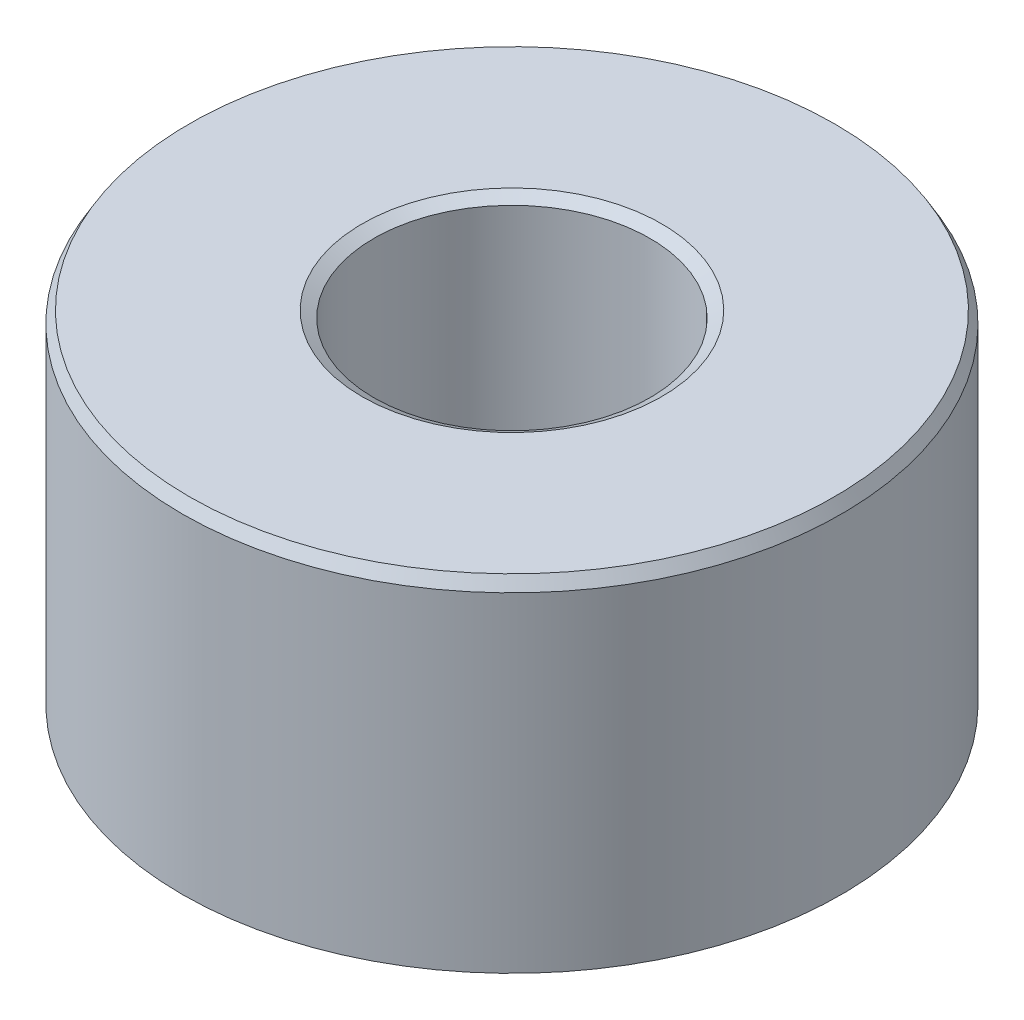
ISO-10303-21;
HEADER;
FILE_DESCRIPTION(('STEP AP214'),'2;1');
FILE_NAME('part.step','',(''),(''),'','','');
FILE_SCHEMA(('AUTOMOTIVE_DESIGN { 1 0 10303 214 1 1 1 1 }'));
ENDSEC;
DATA;
#1=APPLICATION_CONTEXT('core data for automotive mechanical design processes');
#2=APPLICATION_PROTOCOL_DEFINITION('international standard','automotive_design',2000,#1);
#3=PRODUCT_CONTEXT('',#1,'mechanical');
#4=PRODUCT('Part','Part','',(#3));
#5=PRODUCT_RELATED_PRODUCT_CATEGORY('part','',(#4));
#6=PRODUCT_DEFINITION_FORMATION('','',#4);
#7=PRODUCT_DEFINITION_CONTEXT('part definition',#1,'design');
#8=PRODUCT_DEFINITION('design','',#6,#7);
#9=PRODUCT_DEFINITION_SHAPE('','',#8);
#10=(LENGTH_UNIT() NAMED_UNIT(*) SI_UNIT(.MILLI.,.METRE.));
#11=(NAMED_UNIT(*) PLANE_ANGLE_UNIT() SI_UNIT($,.RADIAN.));
#12=(NAMED_UNIT(*) SI_UNIT($,.STERADIAN.) SOLID_ANGLE_UNIT());
#13=UNCERTAINTY_MEASURE_WITH_UNIT(LENGTH_MEASURE(1.E-05),#10,'distance_accuracy_value','');
#14=(GEOMETRIC_REPRESENTATION_CONTEXT(3) GLOBAL_UNCERTAINTY_ASSIGNED_CONTEXT((#13)) GLOBAL_UNIT_ASSIGNED_CONTEXT((#10,
#11,#12)) REPRESENTATION_CONTEXT('',''));
#15=CARTESIAN_POINT('',(0.,0.,0.));
#16=DIRECTION('',(0.,0.,1.));
#17=DIRECTION('',(1.,0.,0.));
#18=AXIS2_PLACEMENT_3D('',#15,#16,#17);
#19=CARTESIAN_POINT('',(0.,63.3569359729989,0.));
#20=DIRECTION('',(0.,-1.,0.));
#21=DIRECTION('',(0.,0.,-1.));
#22=AXIS2_PLACEMENT_3D('',#19,#20,#21);
#23=CYLINDRICAL_SURFACE('',#22,60.);
#24=CARTESIAN_POINT('',(0.,1.23078357689788,0.));
#25=DIRECTION('',(0.,1.,0.));
#26=DIRECTION('',(0.,0.,1.));
#27=AXIS2_PLACEMENT_3D('',#24,#25,#26);
#28=CIRCLE('',#27,60.);
#29=CARTESIAN_POINT('',(0.,1.23078357689788,60.));
#30=VERTEX_POINT('',#29);
#31=EDGE_CURVE('E10',#30,#30,#28,.T.);
#32=ORIENTED_EDGE('',*,*,#31,.T.);
#33=EDGE_LOOP('',(#32));
#34=FACE_BOUND('',#33,.T.);
#35=CARTESIAN_POINT('',(0.,61.2251562846903,0.));
#36=DIRECTION('',(0.,1.,0.));
#37=DIRECTION('',(0.,0.,1.));
#38=AXIS2_PLACEMENT_3D('',#35,#36,#37);
#39=CIRCLE('',#38,60.);
#40=CARTESIAN_POINT('',(0.,61.2251562846903,60.));
#41=VERTEX_POINT('',#40);
#42=EDGE_CURVE('E50',#41,#41,#39,.F.);
#43=ORIENTED_EDGE('',*,*,#42,.T.);
#44=EDGE_LOOP('',(#43));
#45=FACE_BOUND('',#44,.T.);
#46=ADVANCED_FACE('F39',(#34,#45),#23,.T.);
#47=CARTESIAN_POINT('',(0.,63.3569359729989,0.));
#48=DIRECTION('',(0.,1.,0.));
#49=DIRECTION('',(0.,0.,1.));
#50=AXIS2_PLACEMENT_3D('',#47,#48,#49);
#51=PLANE('',#50);
#52=CARTESIAN_POINT('',(0.,63.3569359729989,0.));
#53=DIRECTION('',(0.,1.,0.));
#54=DIRECTION('',(0.,0.,1.));
#55=AXIS2_PLACEMENT_3D('',#52,#53,#54);
#56=CIRCLE('',#55,27.2713775504048);
#57=CARTESIAN_POINT('',(0.,63.3569359729989,27.2713775504048));
#58=VERTEX_POINT('',#57);
#59=EDGE_CURVE('E58',#58,#58,#56,.F.);
#60=ORIENTED_EDGE('',*,*,#59,.T.);
#61=EDGE_LOOP('',(#60));
#62=FACE_BOUND('',#61,.T.);
#63=CARTESIAN_POINT('',(0.,63.3569359729989,0.));
#64=DIRECTION('',(0.,1.,0.));
#65=DIRECTION('',(0.,0.,1.));
#66=AXIS2_PLACEMENT_3D('',#63,#64,#65);
#67=CIRCLE('',#66,58.7692164231021);
#68=CARTESIAN_POINT('',(0.,63.3569359729989,58.7692164231021));
#69=VERTEX_POINT('',#68);
#70=EDGE_CURVE('E61',#69,#69,#67,.T.);
#71=ORIENTED_EDGE('',*,*,#70,.T.);
#72=EDGE_LOOP('',(#71));
#73=FACE_BOUND('',#72,.T.);
#74=ADVANCED_FACE('F88',(#62,#73),#51,.T.);
#75=CARTESIAN_POINT('',(0.,0.,0.));
#76=DIRECTION('',(0.,1.,0.));
#77=DIRECTION('',(0.,0.,1.));
#78=AXIS2_PLACEMENT_3D('',#75,#76,#77);
#79=PLANE('',#78);
#80=CARTESIAN_POINT('',(0.,0.,0.));
#81=DIRECTION('',(0.,1.,0.));
#82=DIRECTION('',(0.,0.,1.));
#83=AXIS2_PLACEMENT_3D('',#80,#81,#82);
#84=CIRCLE('',#83,26.3703814389942);
#85=CARTESIAN_POINT('',(0.,0.,26.3703814389942));
#86=VERTEX_POINT('',#85);
#87=EDGE_CURVE('E51',#86,#86,#84,.T.);
#88=ORIENTED_EDGE('',*,*,#87,.T.);
#89=EDGE_LOOP('',(#88));
#90=FACE_BOUND('',#89,.T.);
#91=CARTESIAN_POINT('',(0.,0.,0.));
#92=DIRECTION('',(0.,1.,0.));
#93=DIRECTION('',(0.,0.,1.));
#94=AXIS2_PLACEMENT_3D('',#91,#92,#93);
#95=CIRCLE('',#94,57.8682203116915);
#96=CARTESIAN_POINT('',(0.,0.,57.8682203116915));
#97=VERTEX_POINT('',#96);
#98=EDGE_CURVE('E54',#97,#97,#95,.F.);
#99=ORIENTED_EDGE('',*,*,#98,.T.);
#100=EDGE_LOOP('',(#99));
#101=FACE_BOUND('',#100,.T.);
#102=ADVANCED_FACE('F83',(#90,#101),#79,.F.);
#103=CARTESIAN_POINT('',(0.,63.3569359729989,0.));
#104=DIRECTION('',(0.,-1.,0.));
#105=DIRECTION('',(0.,0.,-1.));
#106=AXIS2_PLACEMENT_3D('',#103,#104,#105);
#107=CYLINDRICAL_SURFACE('',#106,25.1395978620963);
#108=CARTESIAN_POINT('',(0.,62.126152396101,0.));
#109=DIRECTION('',(0.,1.,0.));
#110=DIRECTION('',(0.,0.,1.));
#111=AXIS2_PLACEMENT_3D('',#108,#109,#110);
#112=CIRCLE('',#111,25.1395978620963);
#113=CARTESIAN_POINT('',(0.,62.126152396101,25.1395978620963));
#114=VERTEX_POINT('',#113);
#115=EDGE_CURVE('E67',#114,#114,#112,.T.);
#116=ORIENTED_EDGE('',*,*,#115,.T.);
#117=EDGE_LOOP('',(#116));
#118=FACE_BOUND('',#117,.T.);
#119=CARTESIAN_POINT('',(0.,2.13177968830852,0.));
#120=DIRECTION('',(0.,1.,0.));
#121=DIRECTION('',(0.,0.,1.));
#122=AXIS2_PLACEMENT_3D('',#119,#120,#121);
#123=CIRCLE('',#122,25.1395978620963);
#124=CARTESIAN_POINT('',(0.,2.13177968830852,25.1395978620963));
#125=VERTEX_POINT('',#124);
#126=EDGE_CURVE('E69',#125,#125,#123,.F.);
#127=ORIENTED_EDGE('',*,*,#126,.T.);
#128=EDGE_LOOP('',(#127));
#129=FACE_BOUND('',#128,.T.);
#130=ADVANCED_FACE('F71',(#118,#129),#107,.F.);
#131=CARTESIAN_POINT('',(0.,62.126152396101,0.));
#132=DIRECTION('',(0.,1.,0.));
#133=DIRECTION('',(0.,0.,1.));
#134=AXIS2_PLACEMENT_3D('',#131,#132,#133);
#135=CONICAL_SURFACE('',#134,25.1395978620963,1.04719755119661);
#136=CARTESIAN_POINT('',(0.,63.3569359729989,27.2713775504048));
#137=CARTESIAN_POINT('',(0.,63.3441153107395,27.249171511985));
#138=CARTESIAN_POINT('',(0.,63.3312946484802,27.2269654735651));
#139=CARTESIAN_POINT('',(0.,63.3056533239615,27.1825533967253));
#140=CARTESIAN_POINT('',(0.,63.2928326617021,27.1603473583054));
#141=CARTESIAN_POINT('',(0.,63.2671913371834,27.1159352814657));
#142=CARTESIAN_POINT('',(0.,63.2543706749241,27.0937292430458));
#143=CARTESIAN_POINT('',(0.,63.2287293504053,27.049317166206));
#144=CARTESIAN_POINT('',(0.,63.215908688146,27.0271111277861));
#145=CARTESIAN_POINT('',(0.,63.1902673636273,26.9826990509464));
#146=CARTESIAN_POINT('',(0.,63.1774467013679,26.9604930125265));
#147=CARTESIAN_POINT('',(0.,63.1518053768492,26.9160809356868));
#148=CARTESIAN_POINT('',(0.,63.1389847145899,26.8938748972669));
#149=CARTESIAN_POINT('',(0.,63.1133433900712,26.8494628204271));
#150=CARTESIAN_POINT('',(0.,63.1005227278118,26.8272567820072));
#151=CARTESIAN_POINT('',(0.,63.0748814032931,26.7828447051675));
#152=CARTESIAN_POINT('',(0.,63.0620607410338,26.7606386667476));
#153=CARTESIAN_POINT('',(0.,63.0364194165151,26.7162265899078));
#154=CARTESIAN_POINT('',(0.,63.0235987542557,26.6940205514879));
#155=CARTESIAN_POINT('',(0.,62.997957429737,26.6496084746482));
#156=CARTESIAN_POINT('',(0.,62.9851367674776,26.6274024362283));
#157=CARTESIAN_POINT('',(0.,62.9594954429589,26.5829903593885));
#158=CARTESIAN_POINT('',(0.,62.9466747806996,26.5607843209687));
#159=CARTESIAN_POINT('',(0.,62.9210334561809,26.5163722441289));
#160=CARTESIAN_POINT('',(0.,62.9082127939215,26.494166205709));
#161=CARTESIAN_POINT('',(0.,62.8825714694028,26.4497541288693));
#162=CARTESIAN_POINT('',(0.,62.8697508071435,26.4275480904494));
#163=CARTESIAN_POINT('',(0.,62.8441094826248,26.3831360136096));
#164=CARTESIAN_POINT('',(0.,62.8312888203654,26.3609299751897));
#165=CARTESIAN_POINT('',(0.,62.8056474958467,26.31651789835));
#166=CARTESIAN_POINT('',(0.,62.7928268335873,26.2943118599301));
#167=CARTESIAN_POINT('',(0.,62.7671855090686,26.2498997830903));
#168=CARTESIAN_POINT('',(0.,62.7543648468093,26.2276937446705));
#169=CARTESIAN_POINT('',(0.,62.7287235222906,26.1832816678307));
#170=CARTESIAN_POINT('',(0.,62.7159028600312,26.1610756294108));
#171=CARTESIAN_POINT('',(0.,62.6902615355125,26.1166635525711));
#172=CARTESIAN_POINT('',(0.,62.6774408732532,26.0944575141512));
#173=CARTESIAN_POINT('',(0.,62.6517995487345,26.0500454373114));
#174=CARTESIAN_POINT('',(0.,62.6389788864751,26.0278393988915));
#175=CARTESIAN_POINT('',(0.,62.6133375619564,25.9834273220518));
#176=CARTESIAN_POINT('',(0.,62.6005168996971,25.9612212836319));
#177=CARTESIAN_POINT('',(0.,62.5748755751784,25.9168092067921));
#178=CARTESIAN_POINT('',(0.,62.562054912919,25.8946031683723));
#179=CARTESIAN_POINT('',(0.,62.5364135884003,25.8501910915325));
#180=CARTESIAN_POINT('',(0.,62.5235929261409,25.8279850531126));
#181=CARTESIAN_POINT('',(0.,62.4979516016222,25.7835729762728));
#182=CARTESIAN_POINT('',(0.,62.4851309393629,25.761366937853));
#183=CARTESIAN_POINT('',(0.,62.4594896148442,25.7169548610132));
#184=CARTESIAN_POINT('',(0.,62.4466689525848,25.6947488225933));
#185=CARTESIAN_POINT('',(0.,62.4210276280661,25.6503367457536));
#186=CARTESIAN_POINT('',(0.,62.4082069658068,25.6281307073337));
#187=CARTESIAN_POINT('',(0.,62.3825656412881,25.5837186304939));
#188=CARTESIAN_POINT('',(0.,62.3697449790287,25.561512592074));
#189=CARTESIAN_POINT('',(0.,62.34410365451,25.5171005152343));
#190=CARTESIAN_POINT('',(0.,62.3312829922506,25.4948944768144));
#191=CARTESIAN_POINT('',(0.,62.3056416677319,25.4504823999746));
#192=CARTESIAN_POINT('',(0.,62.2928210054726,25.4282763615548));
#193=CARTESIAN_POINT('',(0.,62.2671796809539,25.383864284715));
#194=CARTESIAN_POINT('',(0.,62.2543590186945,25.3616582462951));
#195=CARTESIAN_POINT('',(0.,62.2287176941758,25.3172461694554));
#196=CARTESIAN_POINT('',(0.,62.2158970319165,25.2950401310355));
#197=CARTESIAN_POINT('',(0.,62.1902557073978,25.2506280541957));
#198=CARTESIAN_POINT('',(0.,62.1774350451384,25.2284220157758));
#199=CARTESIAN_POINT('',(0.,62.1517937206197,25.1840099389361));
#200=CARTESIAN_POINT('',(0.,62.1389730583603,25.1618039005162));
#201=CARTESIAN_POINT('',(0.,62.126152396101,25.1395978620963));
#202=B_SPLINE_CURVE_WITH_KNOTS('',3,(#136,#137,#138,#139,#140,#141,#142,#143,#144,#145,#146,
#147,#148,#149,#150,#151,#152,#153,#154,#155,#156,#157,#158,#159,#160,#161,#162,#163,#164,#165,
#166,#167,#168,#169,#170,#171,#172,#173,#174,#175,#176,#177,#178,#179,#180,#181,#182,#183,#184,
#185,#186,#187,#188,#189,#190,#191,#192,#193,#194,#195,#196,#197,#198,#199,#200,#201),
.UNSPECIFIED.,.F.,.F.,(4,2,2,2,2,2,2,2,2,2,2,2,2,2,2,2,2,2,2,2,2,2,2,2,2,2,2,2,2,2,2,2,4),(0.,
0.0769239735561165,0.153847947112237,0.230771920668353,0.307695894224467,0.38461986778059,
0.461543841336704,0.538467814892827,0.61539178844894,0.692315762005061,0.769239735561177,
0.846163709117298,0.923087682673414,1.00001165622953,1.07693562978565,1.15385960334177,
1.23078357689789,1.30770755045401,1.38463152401012,1.46155549756625,1.53847947112236,
1.61540344467848,1.6923274182346,1.76925139179072,1.84617536534684,1.92309933890296,
2.00002331245907,2.07694728601519,2.15387125957131,2.23079523312743,2.30771920668355,
2.38464318023966,2.46156715379578),.UNSPECIFIED.);
#203=EDGE_CURVE('BSEAM77',#58,#114,#202,.T.);
#204=ORIENTED_EDGE('',*,*,#59,.F.);
#205=ORIENTED_EDGE('',*,*,#115,.F.);
#206=ORIENTED_EDGE('',*,*,#203,.T.);
#207=ORIENTED_EDGE('',*,*,#203,.F.);
#208=EDGE_LOOP('',(#204,#206,#205,#207));
#209=FACE_BOUND('',#208,.T.);
#210=ADVANCED_FACE('F77',(#209),#135,.F.);
#211=CARTESIAN_POINT('',(0.,0.,0.));
#212=DIRECTION('',(0.,-1.,0.));
#213=DIRECTION('',(0.,0.,-1.));
#214=AXIS2_PLACEMENT_3D('',#211,#212,#213);
#215=CONICAL_SURFACE('',#214,26.3703814389942,0.523598775598295);
#216=ORIENTED_EDGE('',*,*,#126,.F.);
#217=EDGE_LOOP('',(#216));
#218=FACE_BOUND('',#217,.T.);
#219=ORIENTED_EDGE('',*,*,#87,.F.);
#220=EDGE_LOOP('',(#219));
#221=FACE_BOUND('',#220,.T.);
#222=ADVANCED_FACE('F73',(#218,#221),#215,.F.);
#223=CARTESIAN_POINT('',(0.,1.23078357689788,0.));
#224=DIRECTION('',(0.,1.,0.));
#225=DIRECTION('',(0.,0.,1.));
#226=AXIS2_PLACEMENT_3D('',#223,#224,#225);
#227=CONICAL_SURFACE('',#226,60.,1.0471975511966);
#228=CARTESIAN_POINT('',(0.,0.,57.8682203116915));
#229=CARTESIAN_POINT('',(0.,0.0128206622593527,57.8904263501114));
#230=CARTESIAN_POINT('',(0.,0.0256413245187055,57.9126323885313));
#231=CARTESIAN_POINT('',(0.,0.0512826490374113,57.957044465371));
#232=CARTESIAN_POINT('',(0.,0.0641033112967642,57.9792505037909));
#233=CARTESIAN_POINT('',(0.,0.0897446358154699,58.0236625806307));
#234=CARTESIAN_POINT('',(0.,0.102565298074823,58.0458686190506));
#235=CARTESIAN_POINT('',(0.,0.128206622593528,58.0902806958903));
#236=CARTESIAN_POINT('',(0.,0.141027284852881,58.1124867343102));
#237=CARTESIAN_POINT('',(0.,0.166668609371587,58.15689881115));
#238=CARTESIAN_POINT('',(0.,0.17948927163094,58.1791048495698));
#239=CARTESIAN_POINT('',(0.,0.205130596149646,58.2235169264096));
#240=CARTESIAN_POINT('',(0.,0.217951258408999,58.2457229648295));
#241=CARTESIAN_POINT('',(0.,0.243592582927704,58.2901350416692));
#242=CARTESIAN_POINT('',(0.,0.256413245187057,58.3123410800891));
#243=CARTESIAN_POINT('',(0.,0.282054569705763,58.3567531569289));
#244=CARTESIAN_POINT('',(0.,0.294875231965116,58.3789591953487));
#245=CARTESIAN_POINT('',(0.,0.320516556483822,58.4233712721885));
#246=CARTESIAN_POINT('',(0.,0.333337218743175,58.4455773106084));
#247=CARTESIAN_POINT('',(0.,0.358978543261881,58.4899893874482));
#248=CARTESIAN_POINT('',(0.,0.371799205521233,58.512195425868));
#249=CARTESIAN_POINT('',(0.,0.397440530039938,58.5566075027078));
#250=CARTESIAN_POINT('',(0.,0.410261192299291,58.5788135411277));
#251=CARTESIAN_POINT('',(0.,0.435902516817998,58.6232256179674));
#252=CARTESIAN_POINT('',(0.,0.44872317907735,58.6454316563873));
#253=CARTESIAN_POINT('',(0.,0.474364503596056,58.6898437332271));
#254=CARTESIAN_POINT('',(0.,0.487185165855409,58.712049771647));
#255=CARTESIAN_POINT('',(0.,0.512826490374115,58.7564618484867));
#256=CARTESIAN_POINT('',(0.,0.525647152633468,58.7786678869066));
#257=CARTESIAN_POINT('',(0.,0.551288477152173,58.8230799637464));
#258=CARTESIAN_POINT('',(0.,0.564109139411526,58.8452860021662));
#259=CARTESIAN_POINT('',(0.,0.589750463930232,58.889698079006));
#260=CARTESIAN_POINT('',(0.,0.602571126189585,58.9119041174259));
#261=CARTESIAN_POINT('',(0.,0.628212450708291,58.9563161942656));
#262=CARTESIAN_POINT('',(0.,0.641033112967643,58.9785222326855));
#263=CARTESIAN_POINT('',(0.,0.666674437486349,59.0229343095253));
#264=CARTESIAN_POINT('',(0.,0.679495099745702,59.0451403479452));
#265=CARTESIAN_POINT('',(0.,0.705136424264408,59.0895524247849));
#266=CARTESIAN_POINT('',(0.,0.717957086523761,59.1117584632048));
#267=CARTESIAN_POINT('',(0.,0.743598411042466,59.1561705400446));
#268=CARTESIAN_POINT('',(0.,0.756419073301819,59.1783765784644));
#269=CARTESIAN_POINT('',(0.,0.782060397820525,59.2227886553042));
#270=CARTESIAN_POINT('',(0.,0.794881060079878,59.2449946937241));
#271=CARTESIAN_POINT('',(0.,0.820522384598584,59.2894067705638));
#272=CARTESIAN_POINT('',(0.,0.833343046857937,59.3116128089837));
#273=CARTESIAN_POINT('',(0.,0.858984371376642,59.3560248858235));
#274=CARTESIAN_POINT('',(0.,0.871805033635995,59.3782309242434));
#275=CARTESIAN_POINT('',(0.,0.897446358154701,59.4226430010831));
#276=CARTESIAN_POINT('',(0.,0.910267020414054,59.444849039503));
#277=CARTESIAN_POINT('',(0.,0.93590834493276,59.4892611163428));
#278=CARTESIAN_POINT('',(0.,0.948729007192112,59.5114671547626));
#279=CARTESIAN_POINT('',(0.,0.974370331710818,59.5558792316024));
#280=CARTESIAN_POINT('',(0.,0.987190993970171,59.5780852700223));
#281=CARTESIAN_POINT('',(0.,1.01283231848888,59.622497346862));
#282=CARTESIAN_POINT('',(0.,1.02565298074823,59.6447033852819));
#283=CARTESIAN_POINT('',(0.,1.05129430526694,59.6891154621217));
#284=CARTESIAN_POINT('',(0.,1.06411496752629,59.7113215005416));
#285=CARTESIAN_POINT('',(0.,1.08975629204499,59.7557335773813));
#286=CARTESIAN_POINT('',(0.,1.10257695430435,59.7779396158012));
#287=CARTESIAN_POINT('',(0.,1.12821827882305,59.822351692641));
#288=CARTESIAN_POINT('',(0.,1.14103894108241,59.8445577310608));
#289=CARTESIAN_POINT('',(0.,1.16668026560111,59.8889698079006));
#290=CARTESIAN_POINT('',(0.,1.17950092786046,59.9111758463205));
#291=CARTESIAN_POINT('',(0.,1.20514225237917,59.9555879231602));
#292=CARTESIAN_POINT('',(0.,1.21796291463852,59.9777939615801));
#293=CARTESIAN_POINT('',(0.,1.23078357689788,60.));
#294=B_SPLINE_CURVE_WITH_KNOTS('',3,(#228,#229,#230,#231,#232,#233,#234,#235,#236,#237,#238,
#239,#240,#241,#242,#243,#244,#245,#246,#247,#248,#249,#250,#251,#252,#253,#254,#255,#256,#257,
#258,#259,#260,#261,#262,#263,#264,#265,#266,#267,#268,#269,#270,#271,#272,#273,#274,#275,#276,
#277,#278,#279,#280,#281,#282,#283,#284,#285,#286,#287,#288,#289,#290,#291,#292,#293),
.UNSPECIFIED.,.F.,.F.,(4,2,2,2,2,2,2,2,2,2,2,2,2,2,2,2,2,2,2,2,2,2,2,2,2,2,2,2,2,2,2,2,4),(0.,
0.076923973556117,0.153847947112234,0.230771920668351,0.307695894224468,0.384619867780585,
0.461543841336702,0.538467814892818,0.615391788448935,0.692315762005052,0.769239735561175,
0.846163709117292,0.923087682673409,1.00001165622953,1.07693562978564,1.15385960334176,
1.23078357689788,1.30770755045399,1.38463152401011,1.46155549756623,1.53847947112235,
1.61540344467846,1.69232741823458,1.7692513917907,1.84617536534681,1.92309933890294,
2.00002331245905,2.07694728601517,2.15387125957129,2.2307952331274,2.30771920668352,
2.38464318023964,2.46156715379575),.UNSPECIFIED.);
#295=EDGE_CURVE('BSEAM76',#97,#30,#294,.T.);
#296=ORIENTED_EDGE('',*,*,#98,.F.);
#297=ORIENTED_EDGE('',*,*,#31,.F.);
#298=ORIENTED_EDGE('',*,*,#295,.T.);
#299=ORIENTED_EDGE('',*,*,#295,.F.);
#300=EDGE_LOOP('',(#296,#298,#297,#299));
#301=FACE_BOUND('',#300,.T.);
#302=ADVANCED_FACE('F76',(#301),#227,.T.);
#303=CARTESIAN_POINT('',(0.,63.3569359729989,0.));
#304=DIRECTION('',(0.,-1.,0.));
#305=DIRECTION('',(0.,0.,-1.));
#306=AXIS2_PLACEMENT_3D('',#303,#304,#305);
#307=CONICAL_SURFACE('',#306,58.7692164231021,0.523598775598292);
#308=ORIENTED_EDGE('',*,*,#42,.F.);
#309=EDGE_LOOP('',(#308));
#310=FACE_BOUND('',#309,.T.);
#311=ORIENTED_EDGE('',*,*,#70,.F.);
#312=EDGE_LOOP('',(#311));
#313=FACE_BOUND('',#312,.T.);
#314=ADVANCED_FACE('F45',(#310,#313),#307,.T.);
#315=CLOSED_SHELL('',(#46,#74,#102,#130,#210,#222,#302,#314));
#316=MANIFOLD_SOLID_BREP('B2',#315);
#317=ADVANCED_BREP_SHAPE_REPRESENTATION('',(#18,#316),#14);
#318=SHAPE_DEFINITION_REPRESENTATION(#9,#317);
ENDSEC;
END-ISO-10303-21;
